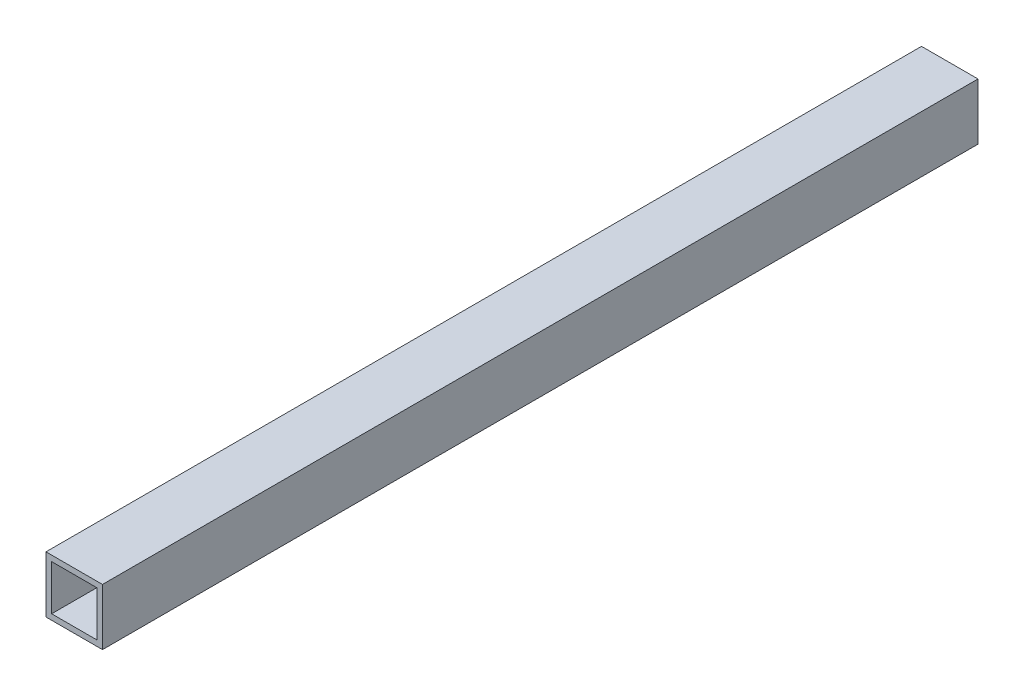
ISO-10303-21;
HEADER;
FILE_DESCRIPTION(('STEP AP214'),'2;1');
FILE_NAME('part.step','',(''),(''),'','','');
FILE_SCHEMA(('AUTOMOTIVE_DESIGN { 1 0 10303 214 1 1 1 1 }'));
ENDSEC;
DATA;
#1=APPLICATION_CONTEXT('core data for automotive mechanical design processes');
#2=APPLICATION_PROTOCOL_DEFINITION('international standard','automotive_design',2000,#1);
#3=PRODUCT_CONTEXT('',#1,'mechanical');
#4=PRODUCT('Part','Part','',(#3));
#5=PRODUCT_RELATED_PRODUCT_CATEGORY('part','',(#4));
#6=PRODUCT_DEFINITION_FORMATION('','',#4);
#7=PRODUCT_DEFINITION_CONTEXT('part definition',#1,'design');
#8=PRODUCT_DEFINITION('design','',#6,#7);
#9=PRODUCT_DEFINITION_SHAPE('','',#8);
#10=(LENGTH_UNIT() NAMED_UNIT(*) SI_UNIT(.MILLI.,.METRE.));
#11=(NAMED_UNIT(*) PLANE_ANGLE_UNIT() SI_UNIT($,.RADIAN.));
#12=(NAMED_UNIT(*) SI_UNIT($,.STERADIAN.) SOLID_ANGLE_UNIT());
#13=UNCERTAINTY_MEASURE_WITH_UNIT(LENGTH_MEASURE(1.E-05),#10,'distance_accuracy_value','');
#14=(GEOMETRIC_REPRESENTATION_CONTEXT(3) GLOBAL_UNCERTAINTY_ASSIGNED_CONTEXT((#13)) GLOBAL_UNIT_ASSIGNED_CONTEXT((#10,
#11,#12)) REPRESENTATION_CONTEXT('',''));
#15=CARTESIAN_POINT('',(0.,0.,0.));
#16=DIRECTION('',(0.,0.,1.));
#17=DIRECTION('',(1.,0.,0.));
#18=AXIS2_PLACEMENT_3D('',#15,#16,#17);
#19=CARTESIAN_POINT('',(-20.,20.,0.));
#20=DIRECTION('',(-1.,0.,0.));
#21=DIRECTION('',(0.,0.,1.));
#22=AXIS2_PLACEMENT_3D('',#19,#20,#21);
#23=PLANE('',#22);
#24=DIRECTION('',(0.,0.,1.));
#25=VECTOR('',#24,1.);
#26=CARTESIAN_POINT('',(-20.,-20.,0.));
#27=LINE('',#26,#25);
#28=CARTESIAN_POINT('',(-20.,-20.,0.));
#29=VERTEX_POINT('',#28);
#30=CARTESIAN_POINT('',(-20.,-20.,620.));
#31=VERTEX_POINT('',#30);
#32=EDGE_CURVE('E90',#29,#31,#27,.T.);
#33=ORIENTED_EDGE('',*,*,#32,.T.);
#34=DIRECTION('',(0.,-1.,0.));
#35=VECTOR('',#34,1.);
#36=CARTESIAN_POINT('',(-20.,20.,620.));
#37=LINE('',#36,#35);
#38=CARTESIAN_POINT('',(-20.,20.,620.));
#39=VERTEX_POINT('',#38);
#40=EDGE_CURVE('E112',#39,#31,#37,.T.);
#41=ORIENTED_EDGE('',*,*,#40,.F.);
#42=DIRECTION('',(0.,0.,1.));
#43=VECTOR('',#42,1.);
#44=CARTESIAN_POINT('',(-20.,20.,0.));
#45=LINE('',#44,#43);
#46=CARTESIAN_POINT('',(-20.,20.,0.));
#47=VERTEX_POINT('',#46);
#48=EDGE_CURVE('E93',#47,#39,#45,.T.);
#49=ORIENTED_EDGE('',*,*,#48,.F.);
#50=DIRECTION('',(0.,-1.,0.));
#51=VECTOR('',#50,1.);
#52=CARTESIAN_POINT('',(-20.,20.,0.));
#53=LINE('',#52,#51);
#54=EDGE_CURVE('E89',#47,#29,#53,.T.);
#55=ORIENTED_EDGE('',*,*,#54,.T.);
#56=EDGE_LOOP('',(#33,#41,#49,#55));
#57=FACE_BOUND('',#56,.T.);
#58=ADVANCED_FACE('F33',(#57),#23,.T.);
#59=CARTESIAN_POINT('',(-20.,-20.,0.));
#60=DIRECTION('',(0.,-1.,0.));
#61=DIRECTION('',(0.,0.,-1.));
#62=AXIS2_PLACEMENT_3D('',#59,#60,#61);
#63=PLANE('',#62);
#64=DIRECTION('',(0.,0.,1.));
#65=VECTOR('',#64,1.);
#66=CARTESIAN_POINT('',(20.,-20.,0.));
#67=LINE('',#66,#65);
#68=CARTESIAN_POINT('',(20.,-20.,0.));
#69=VERTEX_POINT('',#68);
#70=CARTESIAN_POINT('',(20.,-20.,620.));
#71=VERTEX_POINT('',#70);
#72=EDGE_CURVE('E100',#69,#71,#67,.T.);
#73=ORIENTED_EDGE('',*,*,#72,.T.);
#74=DIRECTION('',(1.,0.,0.));
#75=VECTOR('',#74,1.);
#76=CARTESIAN_POINT('',(-20.,-20.,620.));
#77=LINE('',#76,#75);
#78=EDGE_CURVE('E99',#31,#71,#77,.T.);
#79=ORIENTED_EDGE('',*,*,#78,.F.);
#80=ORIENTED_EDGE('',*,*,#32,.F.);
#81=DIRECTION('',(1.,0.,0.));
#82=VECTOR('',#81,1.);
#83=CARTESIAN_POINT('',(-20.,-20.,0.));
#84=LINE('',#83,#82);
#85=EDGE_CURVE('E82',#29,#69,#84,.T.);
#86=ORIENTED_EDGE('',*,*,#85,.T.);
#87=EDGE_LOOP('',(#73,#79,#80,#86));
#88=FACE_BOUND('',#87,.T.);
#89=ADVANCED_FACE('F97',(#88),#63,.T.);
#90=CARTESIAN_POINT('',(20.,20.,0.));
#91=DIRECTION('',(1.,0.,0.));
#92=DIRECTION('',(0.,0.,-1.));
#93=AXIS2_PLACEMENT_3D('',#90,#91,#92);
#94=PLANE('',#93);
#95=DIRECTION('',(0.,0.,1.));
#96=VECTOR('',#95,1.);
#97=CARTESIAN_POINT('',(20.,20.,0.));
#98=LINE('',#97,#96);
#99=CARTESIAN_POINT('',(20.,20.,0.));
#100=VERTEX_POINT('',#99);
#101=CARTESIAN_POINT('',(20.,20.,620.));
#102=VERTEX_POINT('',#101);
#103=EDGE_CURVE('E37',#100,#102,#98,.T.);
#104=ORIENTED_EDGE('',*,*,#103,.T.);
#105=DIRECTION('',(0.,1.,0.));
#106=VECTOR('',#105,1.);
#107=CARTESIAN_POINT('',(20.,20.,620.));
#108=LINE('',#107,#106);
#109=EDGE_CURVE('E109',#71,#102,#108,.T.);
#110=ORIENTED_EDGE('',*,*,#109,.F.);
#111=ORIENTED_EDGE('',*,*,#72,.F.);
#112=DIRECTION('',(0.,1.,0.));
#113=VECTOR('',#112,1.);
#114=CARTESIAN_POINT('',(20.,20.,0.));
#115=LINE('',#114,#113);
#116=EDGE_CURVE('E104',#69,#100,#115,.T.);
#117=ORIENTED_EDGE('',*,*,#116,.T.);
#118=EDGE_LOOP('',(#104,#110,#111,#117));
#119=FACE_BOUND('',#118,.T.);
#120=ADVANCED_FACE('F118',(#119),#94,.T.);
#121=CARTESIAN_POINT('',(-20.,20.,0.));
#122=DIRECTION('',(0.,1.,0.));
#123=DIRECTION('',(0.,0.,1.));
#124=AXIS2_PLACEMENT_3D('',#121,#122,#123);
#125=PLANE('',#124);
#126=DIRECTION('',(-1.,0.,0.));
#127=VECTOR('',#126,1.);
#128=CARTESIAN_POINT('',(-20.,20.,620.));
#129=LINE('',#128,#127);
#130=EDGE_CURVE('E123',#102,#39,#129,.T.);
#131=ORIENTED_EDGE('',*,*,#130,.F.);
#132=ORIENTED_EDGE('',*,*,#103,.F.);
#133=DIRECTION('',(-1.,0.,0.));
#134=VECTOR('',#133,1.);
#135=CARTESIAN_POINT('',(-20.,20.,0.));
#136=LINE('',#135,#134);
#137=EDGE_CURVE('E106',#100,#47,#136,.T.);
#138=ORIENTED_EDGE('',*,*,#137,.T.);
#139=ORIENTED_EDGE('',*,*,#48,.T.);
#140=EDGE_LOOP('',(#131,#132,#138,#139));
#141=FACE_BOUND('',#140,.T.);
#142=ADVANCED_FACE('F35',(#141),#125,.T.);
#143=CARTESIAN_POINT('',(0.,0.,0.));
#144=DIRECTION('',(0.,0.,1.));
#145=DIRECTION('',(1.,0.,0.));
#146=AXIS2_PLACEMENT_3D('',#143,#144,#145);
#147=PLANE('',#146);
#148=DIRECTION('',(0.,-1.,0.));
#149=VECTOR('',#148,1.);
#150=CARTESIAN_POINT('',(-16.,16.,0.));
#151=LINE('',#150,#149);
#152=CARTESIAN_POINT('',(-16.,-16.,0.));
#153=VERTEX_POINT('',#152);
#154=CARTESIAN_POINT('',(-16.,16.,0.));
#155=VERTEX_POINT('',#154);
#156=EDGE_CURVE('E128',#153,#155,#151,.F.);
#157=ORIENTED_EDGE('',*,*,#156,.F.);
#158=DIRECTION('',(1.,0.,0.));
#159=VECTOR('',#158,1.);
#160=CARTESIAN_POINT('',(-16.,-16.,0.));
#161=LINE('',#160,#159);
#162=CARTESIAN_POINT('',(16.,-16.,0.));
#163=VERTEX_POINT('',#162);
#164=EDGE_CURVE('E132',#163,#153,#161,.F.);
#165=ORIENTED_EDGE('',*,*,#164,.F.);
#166=DIRECTION('',(0.,1.,0.));
#167=VECTOR('',#166,1.);
#168=CARTESIAN_POINT('',(16.,16.,0.));
#169=LINE('',#168,#167);
#170=CARTESIAN_POINT('',(16.,16.,0.));
#171=VERTEX_POINT('',#170);
#172=EDGE_CURVE('E139',#171,#163,#169,.F.);
#173=ORIENTED_EDGE('',*,*,#172,.F.);
#174=DIRECTION('',(-1.,0.,0.));
#175=VECTOR('',#174,1.);
#176=CARTESIAN_POINT('',(-16.,16.,0.));
#177=LINE('',#176,#175);
#178=EDGE_CURVE('E124',#155,#171,#177,.F.);
#179=ORIENTED_EDGE('',*,*,#178,.F.);
#180=EDGE_LOOP('',(#157,#165,#173,#179));
#181=FACE_BOUND('',#180,.T.);
#182=ORIENTED_EDGE('',*,*,#54,.F.);
#183=ORIENTED_EDGE('',*,*,#137,.F.);
#184=ORIENTED_EDGE('',*,*,#116,.F.);
#185=ORIENTED_EDGE('',*,*,#85,.F.);
#186=EDGE_LOOP('',(#182,#183,#184,#185));
#187=FACE_BOUND('',#186,.T.);
#188=ADVANCED_FACE('F103',(#181,#187),#147,.F.);
#189=CARTESIAN_POINT('',(0.,0.,620.));
#190=DIRECTION('',(0.,0.,1.));
#191=DIRECTION('',(1.,0.,0.));
#192=AXIS2_PLACEMENT_3D('',#189,#190,#191);
#193=PLANE('',#192);
#194=DIRECTION('',(0.,-1.,0.));
#195=VECTOR('',#194,1.);
#196=CARTESIAN_POINT('',(-16.,16.,620.));
#197=LINE('',#196,#195);
#198=CARTESIAN_POINT('',(-16.,-16.,620.));
#199=VERTEX_POINT('',#198);
#200=CARTESIAN_POINT('',(-16.,16.,620.));
#201=VERTEX_POINT('',#200);
#202=EDGE_CURVE('E11',#199,#201,#197,.F.);
#203=ORIENTED_EDGE('',*,*,#202,.T.);
#204=DIRECTION('',(-1.,0.,0.));
#205=VECTOR('',#204,1.);
#206=CARTESIAN_POINT('',(-16.,16.,620.));
#207=LINE('',#206,#205);
#208=CARTESIAN_POINT('',(16.,16.,620.));
#209=VERTEX_POINT('',#208);
#210=EDGE_CURVE('E149',#201,#209,#207,.F.);
#211=ORIENTED_EDGE('',*,*,#210,.T.);
#212=DIRECTION('',(0.,1.,0.));
#213=VECTOR('',#212,1.);
#214=CARTESIAN_POINT('',(16.,16.,620.));
#215=LINE('',#214,#213);
#216=CARTESIAN_POINT('',(16.,-16.,620.));
#217=VERTEX_POINT('',#216);
#218=EDGE_CURVE('E142',#209,#217,#215,.F.);
#219=ORIENTED_EDGE('',*,*,#218,.T.);
#220=DIRECTION('',(1.,0.,0.));
#221=VECTOR('',#220,1.);
#222=CARTESIAN_POINT('',(-16.,-16.,620.));
#223=LINE('',#222,#221);
#224=EDGE_CURVE('E51',#217,#199,#223,.F.);
#225=ORIENTED_EDGE('',*,*,#224,.T.);
#226=EDGE_LOOP('',(#203,#211,#219,#225));
#227=FACE_BOUND('',#226,.T.);
#228=ORIENTED_EDGE('',*,*,#40,.T.);
#229=ORIENTED_EDGE('',*,*,#78,.T.);
#230=ORIENTED_EDGE('',*,*,#109,.T.);
#231=ORIENTED_EDGE('',*,*,#130,.T.);
#232=EDGE_LOOP('',(#228,#229,#230,#231));
#233=FACE_BOUND('',#232,.T.);
#234=ADVANCED_FACE('F122',(#227,#233),#193,.T.);
#235=CARTESIAN_POINT('',(-16.,16.,0.));
#236=DIRECTION('',(0.,-1.,0.));
#237=DIRECTION('',(0.,0.,-1.));
#238=AXIS2_PLACEMENT_3D('',#235,#236,#237);
#239=PLANE('',#238);
#240=DIRECTION('',(0.,0.,1.));
#241=VECTOR('',#240,1.);
#242=CARTESIAN_POINT('',(16.,16.,0.));
#243=LINE('',#242,#241);
#244=EDGE_CURVE('E144',#171,#209,#243,.T.);
#245=ORIENTED_EDGE('',*,*,#244,.T.);
#246=ORIENTED_EDGE('',*,*,#210,.F.);
#247=DIRECTION('',(0.,0.,1.));
#248=VECTOR('',#247,1.);
#249=CARTESIAN_POINT('',(-16.,16.,0.));
#250=LINE('',#249,#248);
#251=EDGE_CURVE('E131',#155,#201,#250,.T.);
#252=ORIENTED_EDGE('',*,*,#251,.F.);
#253=ORIENTED_EDGE('',*,*,#178,.T.);
#254=EDGE_LOOP('',(#245,#246,#252,#253));
#255=FACE_BOUND('',#254,.T.);
#256=ADVANCED_FACE('F160',(#255),#239,.T.);
#257=CARTESIAN_POINT('',(16.,16.,0.));
#258=DIRECTION('',(-1.,0.,0.));
#259=DIRECTION('',(0.,0.,1.));
#260=AXIS2_PLACEMENT_3D('',#257,#258,#259);
#261=PLANE('',#260);
#262=DIRECTION('',(0.,0.,1.));
#263=VECTOR('',#262,1.);
#264=CARTESIAN_POINT('',(16.,-16.,0.));
#265=LINE('',#264,#263);
#266=EDGE_CURVE('E136',#163,#217,#265,.T.);
#267=ORIENTED_EDGE('',*,*,#266,.T.);
#268=ORIENTED_EDGE('',*,*,#218,.F.);
#269=ORIENTED_EDGE('',*,*,#244,.F.);
#270=ORIENTED_EDGE('',*,*,#172,.T.);
#271=EDGE_LOOP('',(#267,#268,#269,#270));
#272=FACE_BOUND('',#271,.T.);
#273=ADVANCED_FACE('F169',(#272),#261,.T.);
#274=CARTESIAN_POINT('',(-16.,-16.,0.));
#275=DIRECTION('',(0.,1.,0.));
#276=DIRECTION('',(0.,0.,1.));
#277=AXIS2_PLACEMENT_3D('',#274,#275,#276);
#278=PLANE('',#277);
#279=DIRECTION('',(0.,0.,1.));
#280=VECTOR('',#279,1.);
#281=CARTESIAN_POINT('',(-16.,-16.,0.));
#282=LINE('',#281,#280);
#283=EDGE_CURVE('E43',#153,#199,#282,.T.);
#284=ORIENTED_EDGE('',*,*,#283,.T.);
#285=ORIENTED_EDGE('',*,*,#224,.F.);
#286=ORIENTED_EDGE('',*,*,#266,.F.);
#287=ORIENTED_EDGE('',*,*,#164,.T.);
#288=EDGE_LOOP('',(#284,#285,#286,#287));
#289=FACE_BOUND('',#288,.T.);
#290=ADVANCED_FACE('F174',(#289),#278,.T.);
#291=CARTESIAN_POINT('',(-16.,16.,0.));
#292=DIRECTION('',(1.,0.,0.));
#293=DIRECTION('',(0.,0.,-1.));
#294=AXIS2_PLACEMENT_3D('',#291,#292,#293);
#295=PLANE('',#294);
#296=ORIENTED_EDGE('',*,*,#202,.F.);
#297=ORIENTED_EDGE('',*,*,#283,.F.);
#298=ORIENTED_EDGE('',*,*,#156,.T.);
#299=ORIENTED_EDGE('',*,*,#251,.T.);
#300=EDGE_LOOP('',(#296,#297,#298,#299));
#301=FACE_BOUND('',#300,.T.);
#302=ADVANCED_FACE('F178',(#301),#295,.T.);
#303=CLOSED_SHELL('',(#58,#89,#120,#142,#188,#234,#256,#273,#290,#302));
#304=MANIFOLD_SOLID_BREP('B2',#303);
#305=ADVANCED_BREP_SHAPE_REPRESENTATION('',(#18,#304),#14);
#306=SHAPE_DEFINITION_REPRESENTATION(#9,#305);
ENDSEC;
END-ISO-10303-21;
